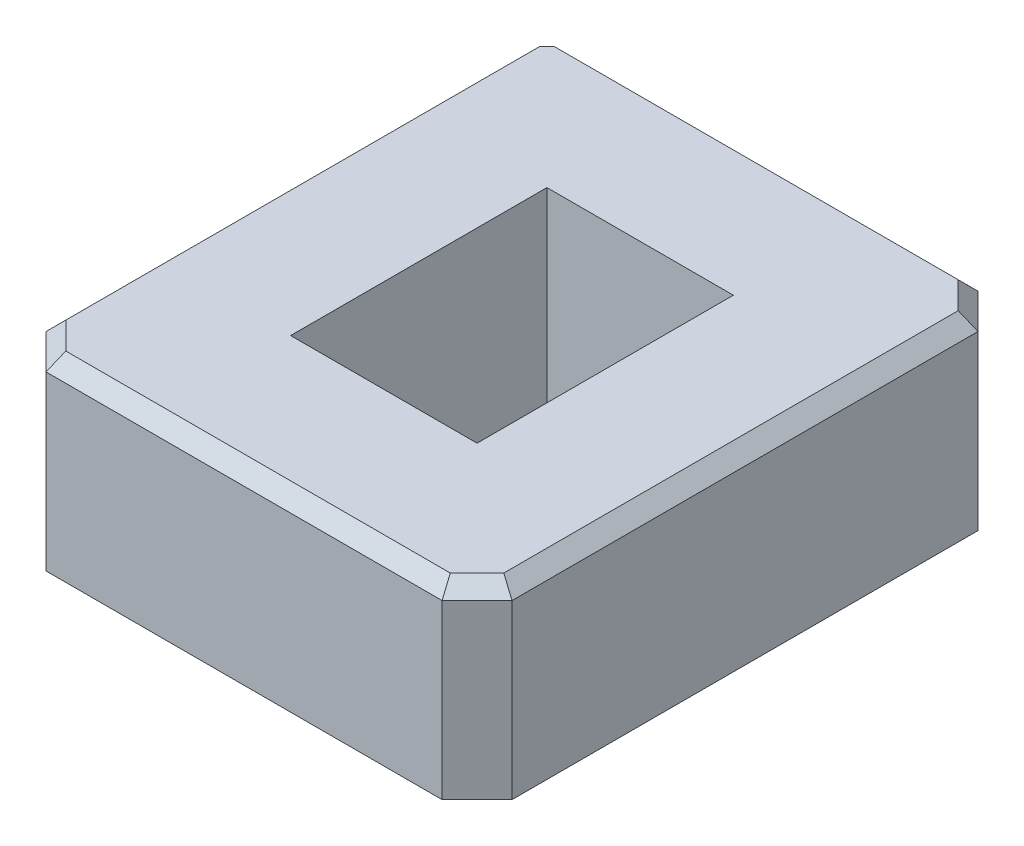
ISO-10303-21;
HEADER;
FILE_DESCRIPTION(('STEP AP214'),'2;1');
FILE_NAME('part.step','',(''),(''),'','','');
FILE_SCHEMA(('AUTOMOTIVE_DESIGN { 1 0 10303 214 1 1 1 1 }'));
ENDSEC;
DATA;
#1=APPLICATION_CONTEXT('core data for automotive mechanical design processes');
#2=APPLICATION_PROTOCOL_DEFINITION('international standard','automotive_design',2000,#1);
#3=PRODUCT_CONTEXT('',#1,'mechanical');
#4=PRODUCT('Part','Part','',(#3));
#5=PRODUCT_RELATED_PRODUCT_CATEGORY('part','',(#4));
#6=PRODUCT_DEFINITION_FORMATION('','',#4);
#7=PRODUCT_DEFINITION_CONTEXT('part definition',#1,'design');
#8=PRODUCT_DEFINITION('design','',#6,#7);
#9=PRODUCT_DEFINITION_SHAPE('','',#8);
#10=(LENGTH_UNIT() NAMED_UNIT(*) SI_UNIT(.MILLI.,.METRE.));
#11=(NAMED_UNIT(*) PLANE_ANGLE_UNIT() SI_UNIT($,.RADIAN.));
#12=(NAMED_UNIT(*) SI_UNIT($,.STERADIAN.) SOLID_ANGLE_UNIT());
#13=UNCERTAINTY_MEASURE_WITH_UNIT(LENGTH_MEASURE(1.E-05),#10,'distance_accuracy_value','');
#14=(GEOMETRIC_REPRESENTATION_CONTEXT(3) GLOBAL_UNCERTAINTY_ASSIGNED_CONTEXT((#13)) GLOBAL_UNIT_ASSIGNED_CONTEXT((#10,
#11,#12)) REPRESENTATION_CONTEXT('',''));
#15=CARTESIAN_POINT('',(0.,0.,0.));
#16=DIRECTION('',(0.,0.,1.));
#17=DIRECTION('',(1.,0.,0.));
#18=AXIS2_PLACEMENT_3D('',#15,#16,#17);
#19=CARTESIAN_POINT('',(0.,8.,0.));
#20=DIRECTION('',(0.,-1.,0.));
#21=DIRECTION('',(0.,0.,-1.));
#22=AXIS2_PLACEMENT_3D('',#19,#20,#21);
#23=PLANE('',#22);
#24=DIRECTION('',(-0.707106781186546,0.,-0.707106781186549));
#25=VECTOR('',#24,1.);
#26=CARTESIAN_POINT('',(8.07573593128806,8.,-11.0757359312881));
#27=LINE('',#26,#25);
#28=CARTESIAN_POINT('',(9.4,8.,-9.75147186257613));
#29=VERTEX_POINT('',#28);
#30=CARTESIAN_POINT('',(8.25147186257613,8.,-10.9));
#31=VERTEX_POINT('',#30);
#32=EDGE_CURVE('E244',#29,#31,#27,.T.);
#33=ORIENTED_EDGE('',*,*,#32,.T.);
#34=DIRECTION('',(-1.,0.,0.));
#35=VECTOR('',#34,1.);
#36=CARTESIAN_POINT('',(0.,8.,-10.9));
#37=LINE('',#36,#35);
#38=CARTESIAN_POINT('',(-9.1,8.,-10.9));
#39=VERTEX_POINT('',#38);
#40=EDGE_CURVE('E246',#31,#39,#37,.T.);
#41=ORIENTED_EDGE('',*,*,#40,.T.);
#42=DIRECTION('',(0.707106781186548,0.,-0.707106781186547));
#43=VECTOR('',#42,1.);
#44=CARTESIAN_POINT('',(-10.,8.,-10.));
#45=LINE('',#44,#43);
#46=CARTESIAN_POINT('',(-9.4,8.,-10.6));
#47=VERTEX_POINT('',#46);
#48=EDGE_CURVE('E222',#39,#47,#45,.F.);
#49=ORIENTED_EDGE('',*,*,#48,.T.);
#50=DIRECTION('',(0.,0.,1.));
#51=VECTOR('',#50,1.);
#52=CARTESIAN_POINT('',(-9.4,8.,0.));
#53=LINE('',#52,#51);
#54=CARTESIAN_POINT('',(-9.4,8.,9.75147186257615));
#55=VERTEX_POINT('',#54);
#56=EDGE_CURVE('E234',#47,#55,#53,.T.);
#57=ORIENTED_EDGE('',*,*,#56,.T.);
#58=DIRECTION('',(0.707106781186547,0.,0.707106781186548));
#59=VECTOR('',#58,1.);
#60=CARTESIAN_POINT('',(-8.07573593128808,8.,11.0757359312881));
#61=LINE('',#60,#59);
#62=CARTESIAN_POINT('',(-8.25147186257615,8.,10.9));
#63=VERTEX_POINT('',#62);
#64=EDGE_CURVE('E236',#55,#63,#61,.T.);
#65=ORIENTED_EDGE('',*,*,#64,.T.);
#66=DIRECTION('',(1.,0.,0.));
#67=VECTOR('',#66,1.);
#68=CARTESIAN_POINT('',(0.,8.,10.9));
#69=LINE('',#68,#67);
#70=CARTESIAN_POINT('',(8.25147186257614,8.,10.9));
#71=VERTEX_POINT('',#70);
#72=EDGE_CURVE('E238',#63,#71,#69,.T.);
#73=ORIENTED_EDGE('',*,*,#72,.T.);
#74=DIRECTION('',(0.707106781186548,0.,-0.707106781186548));
#75=VECTOR('',#74,1.);
#76=CARTESIAN_POINT('',(9.57573593128807,8.,9.57573593128807));
#77=LINE('',#76,#75);
#78=CARTESIAN_POINT('',(9.4,8.,9.75147186257614));
#79=VERTEX_POINT('',#78);
#80=EDGE_CURVE('E240',#71,#79,#77,.T.);
#81=ORIENTED_EDGE('',*,*,#80,.T.);
#82=DIRECTION('',(0.,0.,-1.));
#83=VECTOR('',#82,1.);
#84=CARTESIAN_POINT('',(9.4,8.,0.));
#85=LINE('',#84,#83);
#86=EDGE_CURVE('E242',#79,#29,#85,.T.);
#87=ORIENTED_EDGE('',*,*,#86,.T.);
#88=EDGE_LOOP('',(#33,#41,#49,#57,#65,#73,#81,#87));
#89=FACE_BOUND('',#88,.T.);
#90=DIRECTION('',(0.,0.,-1.));
#91=VECTOR('',#90,1.);
#92=CARTESIAN_POINT('',(4.,8.,5.5));
#93=LINE('',#92,#91);
#94=CARTESIAN_POINT('',(4.,8.,5.5));
#95=VERTEX_POINT('',#94);
#96=CARTESIAN_POINT('',(4.,8.,-5.5));
#97=VERTEX_POINT('',#96);
#98=EDGE_CURVE('E153',#95,#97,#93,.T.);
#99=ORIENTED_EDGE('',*,*,#98,.F.);
#100=DIRECTION('',(1.,0.,0.));
#101=VECTOR('',#100,1.);
#102=CARTESIAN_POINT('',(-4.,8.,5.5));
#103=LINE('',#102,#101);
#104=CARTESIAN_POINT('',(-4.,8.,5.5));
#105=VERTEX_POINT('',#104);
#106=EDGE_CURVE('E178',#105,#95,#103,.T.);
#107=ORIENTED_EDGE('',*,*,#106,.F.);
#108=DIRECTION('',(0.,0.,1.));
#109=VECTOR('',#108,1.);
#110=CARTESIAN_POINT('',(-4.,8.,5.5));
#111=LINE('',#110,#109);
#112=CARTESIAN_POINT('',(-4.,8.,-5.5));
#113=VERTEX_POINT('',#112);
#114=EDGE_CURVE('E176',#113,#105,#111,.T.);
#115=ORIENTED_EDGE('',*,*,#114,.F.);
#116=DIRECTION('',(-1.,0.,0.));
#117=VECTOR('',#116,1.);
#118=CARTESIAN_POINT('',(-4.,8.,-5.5));
#119=LINE('',#118,#117);
#120=EDGE_CURVE('E163',#97,#113,#119,.T.);
#121=ORIENTED_EDGE('',*,*,#120,.F.);
#122=EDGE_LOOP('',(#99,#107,#115,#121));
#123=FACE_BOUND('',#122,.T.);
#124=ADVANCED_FACE('F36',(#89,#123),#23,.F.);
#125=CARTESIAN_POINT('',(0.,0.,0.));
#126=DIRECTION('',(0.,-1.,0.));
#127=DIRECTION('',(0.,0.,-1.));
#128=AXIS2_PLACEMENT_3D('',#125,#126,#127);
#129=PLANE('',#128);
#130=DIRECTION('',(0.,0.,-1.));
#131=VECTOR('',#130,1.);
#132=CARTESIAN_POINT('',(10.,0.,11.5));
#133=LINE('',#132,#131);
#134=CARTESIAN_POINT('',(10.,0.,10.));
#135=VERTEX_POINT('',#134);
#136=CARTESIAN_POINT('',(10.,0.,-9.99999999999998));
#137=VERTEX_POINT('',#136);
#138=EDGE_CURVE('E199',#135,#137,#133,.T.);
#139=ORIENTED_EDGE('',*,*,#138,.F.);
#140=DIRECTION('',(0.707106781186548,0.,-0.707106781186548));
#141=VECTOR('',#140,1.);
#142=CARTESIAN_POINT('',(10.,0.,10.));
#143=LINE('',#142,#141);
#144=CARTESIAN_POINT('',(8.49999999999999,0.,11.5));
#145=VERTEX_POINT('',#144);
#146=EDGE_CURVE('E216',#135,#145,#143,.F.);
#147=ORIENTED_EDGE('',*,*,#146,.T.);
#148=DIRECTION('',(1.,0.,0.));
#149=VECTOR('',#148,1.);
#150=CARTESIAN_POINT('',(-10.,0.,11.5));
#151=LINE('',#150,#149);
#152=CARTESIAN_POINT('',(-8.5,0.,11.5));
#153=VERTEX_POINT('',#152);
#154=EDGE_CURVE('E196',#153,#145,#151,.T.);
#155=ORIENTED_EDGE('',*,*,#154,.F.);
#156=DIRECTION('',(0.707106781186547,0.,0.707106781186548));
#157=VECTOR('',#156,1.);
#158=CARTESIAN_POINT('',(-10.,0.,9.99999999999999));
#159=LINE('',#158,#157);
#160=CARTESIAN_POINT('',(-10.,0.,10.));
#161=VERTEX_POINT('',#160);
#162=EDGE_CURVE('E210',#153,#161,#159,.F.);
#163=ORIENTED_EDGE('',*,*,#162,.T.);
#164=DIRECTION('',(0.,0.,1.));
#165=VECTOR('',#164,1.);
#166=CARTESIAN_POINT('',(-10.,0.,11.5));
#167=LINE('',#166,#165);
#168=CARTESIAN_POINT('',(-10.,0.,-10.));
#169=VERTEX_POINT('',#168);
#170=EDGE_CURVE('E171',#169,#161,#167,.T.);
#171=ORIENTED_EDGE('',*,*,#170,.F.);
#172=DIRECTION('',(-0.707106781186548,0.,0.707106781186547));
#173=VECTOR('',#172,1.);
#174=CARTESIAN_POINT('',(-9.99999999999999,0.,-10.));
#175=LINE('',#174,#173);
#176=CARTESIAN_POINT('',(-8.5,0.,-11.5));
#177=VERTEX_POINT('',#176);
#178=EDGE_CURVE('E212',#169,#177,#175,.F.);
#179=ORIENTED_EDGE('',*,*,#178,.T.);
#180=DIRECTION('',(-1.,0.,0.));
#181=VECTOR('',#180,1.);
#182=CARTESIAN_POINT('',(-10.,0.,-11.5));
#183=LINE('',#182,#181);
#184=CARTESIAN_POINT('',(8.49999999999999,0.,-11.5));
#185=VERTEX_POINT('',#184);
#186=EDGE_CURVE('E202',#185,#177,#183,.T.);
#187=ORIENTED_EDGE('',*,*,#186,.F.);
#188=DIRECTION('',(-0.707106781186546,0.,-0.707106781186549));
#189=VECTOR('',#188,1.);
#190=CARTESIAN_POINT('',(10.,0.,-9.99999999999997));
#191=LINE('',#190,#189);
#192=EDGE_CURVE('E214',#185,#137,#191,.F.);
#193=ORIENTED_EDGE('',*,*,#192,.T.);
#194=EDGE_LOOP('',(#139,#147,#155,#163,#171,#179,#187,#193));
#195=FACE_BOUND('',#194,.T.);
#196=DIRECTION('',(1.,0.,0.));
#197=VECTOR('',#196,1.);
#198=CARTESIAN_POINT('',(-4.,0.,5.5));
#199=LINE('',#198,#197);
#200=CARTESIAN_POINT('',(-4.,0.,5.5));
#201=VERTEX_POINT('',#200);
#202=CARTESIAN_POINT('',(4.,0.,5.5));
#203=VERTEX_POINT('',#202);
#204=EDGE_CURVE('E164',#201,#203,#199,.T.);
#205=ORIENTED_EDGE('',*,*,#204,.T.);
#206=DIRECTION('',(0.,0.,-1.));
#207=VECTOR('',#206,1.);
#208=CARTESIAN_POINT('',(4.,0.,5.5));
#209=LINE('',#208,#207);
#210=CARTESIAN_POINT('',(4.,0.,-5.5));
#211=VERTEX_POINT('',#210);
#212=EDGE_CURVE('E182',#203,#211,#209,.T.);
#213=ORIENTED_EDGE('',*,*,#212,.T.);
#214=DIRECTION('',(-1.,0.,0.));
#215=VECTOR('',#214,1.);
#216=CARTESIAN_POINT('',(-4.,0.,-5.5));
#217=LINE('',#216,#215);
#218=CARTESIAN_POINT('',(-4.,0.,-5.5));
#219=VERTEX_POINT('',#218);
#220=EDGE_CURVE('E170',#211,#219,#217,.T.);
#221=ORIENTED_EDGE('',*,*,#220,.T.);
#222=DIRECTION('',(0.,0.,1.));
#223=VECTOR('',#222,1.);
#224=CARTESIAN_POINT('',(-4.,0.,5.5));
#225=LINE('',#224,#223);
#226=EDGE_CURVE('E185',#219,#201,#225,.T.);
#227=ORIENTED_EDGE('',*,*,#226,.T.);
#228=EDGE_LOOP('',(#205,#213,#221,#227));
#229=FACE_BOUND('',#228,.T.);
#230=ADVANCED_FACE('F300',(#195,#229),#129,.T.);
#231=CARTESIAN_POINT('',(-10.,8.,11.5));
#232=DIRECTION('',(1.,0.,0.));
#233=DIRECTION('',(0.,0.,-1.));
#234=AXIS2_PLACEMENT_3D('',#231,#232,#233);
#235=PLANE('',#234);
#236=DIRECTION('',(0.,1.,0.));
#237=VECTOR('',#236,1.);
#238=CARTESIAN_POINT('',(-10.,8.,10.));
#239=LINE('',#238,#237);
#240=CARTESIAN_POINT('',(-10.,7.4,10.));
#241=VERTEX_POINT('',#240);
#242=EDGE_CURVE('E230',#161,#241,#239,.T.);
#243=ORIENTED_EDGE('',*,*,#242,.T.);
#244=DIRECTION('',(0.,0.,-1.));
#245=VECTOR('',#244,1.);
#246=CARTESIAN_POINT('',(-10.,7.4,11.5));
#247=LINE('',#246,#245);
#248=CARTESIAN_POINT('',(-10.,7.4,-10.));
#249=VERTEX_POINT('',#248);
#250=EDGE_CURVE('E11',#241,#249,#247,.T.);
#251=ORIENTED_EDGE('',*,*,#250,.T.);
#252=DIRECTION('',(0.,-1.,0.));
#253=VECTOR('',#252,1.);
#254=CARTESIAN_POINT('',(-10.,8.,-10.));
#255=LINE('',#254,#253);
#256=EDGE_CURVE('E232',#249,#169,#255,.T.);
#257=ORIENTED_EDGE('',*,*,#256,.T.);
#258=ORIENTED_EDGE('',*,*,#170,.T.);
#259=EDGE_LOOP('',(#243,#251,#257,#258));
#260=FACE_BOUND('',#259,.T.);
#261=ADVANCED_FACE('F290',(#260),#235,.F.);
#262=CARTESIAN_POINT('',(-10.,8.,11.5));
#263=DIRECTION('',(0.,0.,-1.));
#264=DIRECTION('',(-1.,0.,0.));
#265=AXIS2_PLACEMENT_3D('',#262,#263,#264);
#266=PLANE('',#265);
#267=DIRECTION('',(0.,1.,0.));
#268=VECTOR('',#267,1.);
#269=CARTESIAN_POINT('',(8.49999999999999,8.,11.5));
#270=LINE('',#269,#268);
#271=CARTESIAN_POINT('',(8.49999999999999,7.4,11.5));
#272=VERTEX_POINT('',#271);
#273=EDGE_CURVE('E220',#145,#272,#270,.T.);
#274=ORIENTED_EDGE('',*,*,#273,.T.);
#275=DIRECTION('',(-1.,0.,0.));
#276=VECTOR('',#275,1.);
#277=CARTESIAN_POINT('',(-10.,7.4,11.5));
#278=LINE('',#277,#276);
#279=CARTESIAN_POINT('',(-8.5,7.4,11.5));
#280=VERTEX_POINT('',#279);
#281=EDGE_CURVE('E61',#272,#280,#278,.T.);
#282=ORIENTED_EDGE('',*,*,#281,.T.);
#283=DIRECTION('',(0.,-1.,0.));
#284=VECTOR('',#283,1.);
#285=CARTESIAN_POINT('',(-8.5,8.,11.5));
#286=LINE('',#285,#284);
#287=EDGE_CURVE('E218',#280,#153,#286,.T.);
#288=ORIENTED_EDGE('',*,*,#287,.T.);
#289=ORIENTED_EDGE('',*,*,#154,.T.);
#290=EDGE_LOOP('',(#274,#282,#288,#289));
#291=FACE_BOUND('',#290,.T.);
#292=ADVANCED_FACE('F307',(#291),#266,.F.);
#293=CARTESIAN_POINT('',(10.,8.,11.5));
#294=DIRECTION('',(-1.,0.,0.));
#295=DIRECTION('',(0.,0.,1.));
#296=AXIS2_PLACEMENT_3D('',#293,#294,#295);
#297=PLANE('',#296);
#298=DIRECTION('',(0.,1.,0.));
#299=VECTOR('',#298,1.);
#300=CARTESIAN_POINT('',(10.,8.,-9.99999999999998));
#301=LINE('',#300,#299);
#302=CARTESIAN_POINT('',(10.,7.4,-9.99999999999998));
#303=VERTEX_POINT('',#302);
#304=EDGE_CURVE('E205',#137,#303,#301,.T.);
#305=ORIENTED_EDGE('',*,*,#304,.T.);
#306=DIRECTION('',(0.,0.,1.));
#307=VECTOR('',#306,1.);
#308=CARTESIAN_POINT('',(10.,7.4,11.5));
#309=LINE('',#308,#307);
#310=CARTESIAN_POINT('',(10.,7.4,10.));
#311=VERTEX_POINT('',#310);
#312=EDGE_CURVE('E257',#303,#311,#309,.T.);
#313=ORIENTED_EDGE('',*,*,#312,.T.);
#314=DIRECTION('',(0.,-1.,0.));
#315=VECTOR('',#314,1.);
#316=CARTESIAN_POINT('',(10.,8.,10.));
#317=LINE('',#316,#315);
#318=EDGE_CURVE('E208',#311,#135,#317,.T.);
#319=ORIENTED_EDGE('',*,*,#318,.T.);
#320=ORIENTED_EDGE('',*,*,#138,.T.);
#321=EDGE_LOOP('',(#305,#313,#319,#320));
#322=FACE_BOUND('',#321,.T.);
#323=ADVANCED_FACE('F346',(#322),#297,.F.);
#324=CARTESIAN_POINT('',(-10.,8.,-11.5));
#325=DIRECTION('',(0.,0.,1.));
#326=DIRECTION('',(1.,0.,0.));
#327=AXIS2_PLACEMENT_3D('',#324,#325,#326);
#328=PLANE('',#327);
#329=DIRECTION('',(0.,1.,0.));
#330=VECTOR('',#329,1.);
#331=CARTESIAN_POINT('',(-8.5,8.,-11.5));
#332=LINE('',#331,#330);
#333=CARTESIAN_POINT('',(-8.5,7.4,-11.5));
#334=VERTEX_POINT('',#333);
#335=EDGE_CURVE('E225',#177,#334,#332,.T.);
#336=ORIENTED_EDGE('',*,*,#335,.T.);
#337=DIRECTION('',(1.,0.,0.));
#338=VECTOR('',#337,1.);
#339=CARTESIAN_POINT('',(-10.,7.4,-11.5));
#340=LINE('',#339,#338);
#341=CARTESIAN_POINT('',(8.49999999999999,7.4,-11.5));
#342=VERTEX_POINT('',#341);
#343=EDGE_CURVE('E253',#334,#342,#340,.T.);
#344=ORIENTED_EDGE('',*,*,#343,.T.);
#345=DIRECTION('',(0.,-1.,0.));
#346=VECTOR('',#345,1.);
#347=CARTESIAN_POINT('',(8.49999999999999,8.,-11.5));
#348=LINE('',#347,#346);
#349=EDGE_CURVE('E228',#342,#185,#348,.T.);
#350=ORIENTED_EDGE('',*,*,#349,.T.);
#351=ORIENTED_EDGE('',*,*,#186,.T.);
#352=EDGE_LOOP('',(#336,#344,#350,#351));
#353=FACE_BOUND('',#352,.T.);
#354=ADVANCED_FACE('F343',(#353),#328,.F.);
#355=CARTESIAN_POINT('',(4.,8.,5.5));
#356=DIRECTION('',(-1.,0.,0.));
#357=DIRECTION('',(0.,0.,1.));
#358=AXIS2_PLACEMENT_3D('',#355,#356,#357);
#359=PLANE('',#358);
#360=ORIENTED_EDGE('',*,*,#212,.F.);
#361=DIRECTION('',(0.,-1.,0.));
#362=VECTOR('',#361,1.);
#363=CARTESIAN_POINT('',(4.,8.,5.5));
#364=LINE('',#363,#362);
#365=EDGE_CURVE('E159',#95,#203,#364,.T.);
#366=ORIENTED_EDGE('',*,*,#365,.F.);
#367=ORIENTED_EDGE('',*,*,#98,.T.);
#368=DIRECTION('',(0.,-1.,0.));
#369=VECTOR('',#368,1.);
#370=CARTESIAN_POINT('',(4.,8.,-5.5));
#371=LINE('',#370,#369);
#372=EDGE_CURVE('E156',#97,#211,#371,.T.);
#373=ORIENTED_EDGE('',*,*,#372,.T.);
#374=EDGE_LOOP('',(#360,#366,#367,#373));
#375=FACE_BOUND('',#374,.T.);
#376=ADVANCED_FACE('F155',(#375),#359,.T.);
#377=CARTESIAN_POINT('',(-4.,8.,-5.5));
#378=DIRECTION('',(0.,0.,1.));
#379=DIRECTION('',(1.,0.,0.));
#380=AXIS2_PLACEMENT_3D('',#377,#378,#379);
#381=PLANE('',#380);
#382=ORIENTED_EDGE('',*,*,#220,.F.);
#383=ORIENTED_EDGE('',*,*,#372,.F.);
#384=ORIENTED_EDGE('',*,*,#120,.T.);
#385=DIRECTION('',(0.,-1.,0.));
#386=VECTOR('',#385,1.);
#387=CARTESIAN_POINT('',(-4.,8.,-5.5));
#388=LINE('',#387,#386);
#389=EDGE_CURVE('E172',#113,#219,#388,.T.);
#390=ORIENTED_EDGE('',*,*,#389,.T.);
#391=EDGE_LOOP('',(#382,#383,#384,#390));
#392=FACE_BOUND('',#391,.T.);
#393=ADVANCED_FACE('F167',(#392),#381,.T.);
#394=CARTESIAN_POINT('',(-4.,8.,5.5));
#395=DIRECTION('',(1.,0.,0.));
#396=DIRECTION('',(0.,0.,-1.));
#397=AXIS2_PLACEMENT_3D('',#394,#395,#396);
#398=PLANE('',#397);
#399=ORIENTED_EDGE('',*,*,#226,.F.);
#400=ORIENTED_EDGE('',*,*,#389,.F.);
#401=ORIENTED_EDGE('',*,*,#114,.T.);
#402=DIRECTION('',(0.,-1.,0.));
#403=VECTOR('',#402,1.);
#404=CARTESIAN_POINT('',(-4.,8.,5.5));
#405=LINE('',#404,#403);
#406=EDGE_CURVE('E191',#105,#201,#405,.T.);
#407=ORIENTED_EDGE('',*,*,#406,.T.);
#408=EDGE_LOOP('',(#399,#400,#401,#407));
#409=FACE_BOUND('',#408,.T.);
#410=ADVANCED_FACE('F472',(#409),#398,.T.);
#411=CARTESIAN_POINT('',(-4.,8.,5.5));
#412=DIRECTION('',(0.,0.,-1.));
#413=DIRECTION('',(-1.,0.,0.));
#414=AXIS2_PLACEMENT_3D('',#411,#412,#413);
#415=PLANE('',#414);
#416=ORIENTED_EDGE('',*,*,#204,.F.);
#417=ORIENTED_EDGE('',*,*,#406,.F.);
#418=ORIENTED_EDGE('',*,*,#106,.T.);
#419=ORIENTED_EDGE('',*,*,#365,.T.);
#420=EDGE_LOOP('',(#416,#417,#418,#419));
#421=FACE_BOUND('',#420,.T.);
#422=ADVANCED_FACE('F362',(#421),#415,.T.);
#423=CARTESIAN_POINT('',(10.,8.,10.));
#424=DIRECTION('',(-0.707106781186547,0.,-0.707106781186547));
#425=DIRECTION('',(0.,-1.,0.));
#426=AXIS2_PLACEMENT_3D('',#423,#424,#425);
#427=PLANE('',#426);
#428=ORIENTED_EDGE('',*,*,#318,.F.);
#429=DIRECTION('',(0.707106781186548,0.,-0.707106781186548));
#430=VECTOR('',#429,1.);
#431=CARTESIAN_POINT('',(8.49999999999999,7.4,11.5));
#432=LINE('',#431,#430);
#433=EDGE_CURVE('E259',#311,#272,#432,.F.);
#434=ORIENTED_EDGE('',*,*,#433,.T.);
#435=ORIENTED_EDGE('',*,*,#273,.F.);
#436=ORIENTED_EDGE('',*,*,#146,.F.);
#437=EDGE_LOOP('',(#428,#434,#435,#436));
#438=FACE_BOUND('',#437,.T.);
#439=ADVANCED_FACE('F310',(#438),#427,.F.);
#440=CARTESIAN_POINT('',(8.49999999999999,8.,-11.5));
#441=DIRECTION('',(-0.707106781186549,0.,0.707106781186546));
#442=DIRECTION('',(0.,-1.,0.));
#443=AXIS2_PLACEMENT_3D('',#440,#441,#442);
#444=PLANE('',#443);
#445=ORIENTED_EDGE('',*,*,#349,.F.);
#446=DIRECTION('',(-0.707106781186546,0.,-0.707106781186549));
#447=VECTOR('',#446,1.);
#448=CARTESIAN_POINT('',(10.,7.4,-9.99999999999998));
#449=LINE('',#448,#447);
#450=EDGE_CURVE('E255',#342,#303,#449,.F.);
#451=ORIENTED_EDGE('',*,*,#450,.T.);
#452=ORIENTED_EDGE('',*,*,#304,.F.);
#453=ORIENTED_EDGE('',*,*,#192,.F.);
#454=EDGE_LOOP('',(#445,#451,#452,#453));
#455=FACE_BOUND('',#454,.T.);
#456=ADVANCED_FACE('F361',(#455),#444,.F.);
#457=CARTESIAN_POINT('',(-10.,8.,-10.));
#458=DIRECTION('',(0.707106781186547,0.,0.707106781186548));
#459=DIRECTION('',(0.,-1.,0.));
#460=AXIS2_PLACEMENT_3D('',#457,#458,#459);
#461=PLANE('',#460);
#462=ORIENTED_EDGE('',*,*,#48,.F.);
#463=DIRECTION('',(0.577350269189625,-0.577350269189628,-0.577350269189624));
#464=VECTOR('',#463,1.);
#465=CARTESIAN_POINT('',(-9.7,8.6,-10.3));
#466=LINE('',#465,#464);
#467=EDGE_CURVE('E251',#39,#334,#466,.T.);
#468=ORIENTED_EDGE('',*,*,#467,.T.);
#469=ORIENTED_EDGE('',*,*,#335,.F.);
#470=ORIENTED_EDGE('',*,*,#178,.F.);
#471=ORIENTED_EDGE('',*,*,#256,.F.);
#472=DIRECTION('',(0.577350269189625,0.577350269189629,-0.577350269189624));
#473=VECTOR('',#472,1.);
#474=CARTESIAN_POINT('',(-9.8,7.6,-10.2));
#475=LINE('',#474,#473);
#476=EDGE_CURVE('E249',#249,#47,#475,.T.);
#477=ORIENTED_EDGE('',*,*,#476,.T.);
#478=EDGE_LOOP('',(#462,#468,#469,#470,#471,#477));
#479=FACE_BOUND('',#478,.T.);
#480=ADVANCED_FACE('F294',(#479),#461,.F.);
#481=CARTESIAN_POINT('',(-8.5,8.,11.5));
#482=DIRECTION('',(0.707106781186548,0.,-0.707106781186547));
#483=DIRECTION('',(0.,-1.,0.));
#484=AXIS2_PLACEMENT_3D('',#481,#482,#483);
#485=PLANE('',#484);
#486=ORIENTED_EDGE('',*,*,#287,.F.);
#487=DIRECTION('',(0.707106781186547,0.,0.707106781186548));
#488=VECTOR('',#487,1.);
#489=CARTESIAN_POINT('',(-10.,7.4,10.));
#490=LINE('',#489,#488);
#491=EDGE_CURVE('E46',#280,#241,#490,.F.);
#492=ORIENTED_EDGE('',*,*,#491,.T.);
#493=ORIENTED_EDGE('',*,*,#242,.F.);
#494=ORIENTED_EDGE('',*,*,#162,.F.);
#495=EDGE_LOOP('',(#486,#492,#493,#494));
#496=FACE_BOUND('',#495,.T.);
#497=ADVANCED_FACE('F304',(#496),#485,.F.);
#498=CARTESIAN_POINT('',(-9.4,8.,0.));
#499=DIRECTION('',(0.70710678118655,-0.707106781186546,0.));
#500=DIRECTION('',(0.,0.,1.));
#501=AXIS2_PLACEMENT_3D('',#498,#499,#500);
#502=PLANE('',#501);
#503=ORIENTED_EDGE('',*,*,#476,.F.);
#504=ORIENTED_EDGE('',*,*,#250,.F.);
#505=DIRECTION('',(0.678598344545846,0.67859834454585,-0.281084637714817));
#506=VECTOR('',#505,1.);
#507=CARTESIAN_POINT('',(-7.53996944583013,9.86003055416989,8.98102198061065));
#508=LINE('',#507,#506);
#509=EDGE_CURVE('E41',#55,#241,#508,.F.);
#510=ORIENTED_EDGE('',*,*,#509,.F.);
#511=ORIENTED_EDGE('',*,*,#56,.F.);
#512=EDGE_LOOP('',(#503,#504,#510,#511));
#513=FACE_BOUND('',#512,.T.);
#514=ADVANCED_FACE('F39',(#513),#502,.F.);
#515=CARTESIAN_POINT('',(-9.57573593128808,8.,9.57573593128806));
#516=DIRECTION('',(0.500000000000003,-0.707106781186545,-0.500000000000001));
#517=DIRECTION('',(0.707106781186547,0.,0.707106781186548));
#518=AXIS2_PLACEMENT_3D('',#515,#516,#517);
#519=PLANE('',#518);
#520=ORIENTED_EDGE('',*,*,#509,.T.);
#521=ORIENTED_EDGE('',*,*,#491,.F.);
#522=DIRECTION('',(0.281084637714818,0.67859834454585,-0.678598344545846));
#523=VECTOR('',#522,1.);
#524=CARTESIAN_POINT('',(-8.10350522179644,8.35722307094917,10.5427769290508));
#525=LINE('',#524,#523);
#526=EDGE_CURVE('E274',#63,#280,#525,.F.);
#527=ORIENTED_EDGE('',*,*,#526,.F.);
#528=ORIENTED_EDGE('',*,*,#64,.F.);
#529=EDGE_LOOP('',(#520,#521,#527,#528));
#530=FACE_BOUND('',#529,.T.);
#531=ADVANCED_FACE('F283',(#530),#519,.F.);
#532=CARTESIAN_POINT('',(0.,8.,10.9));
#533=DIRECTION('',(0.,-0.707106781186546,-0.70710678118655));
#534=DIRECTION('',(1.,0.,0.));
#535=AXIS2_PLACEMENT_3D('',#532,#533,#534);
#536=PLANE('',#535);
#537=ORIENTED_EDGE('',*,*,#526,.T.);
#538=ORIENTED_EDGE('',*,*,#281,.F.);
#539=DIRECTION('',(-0.281084637714819,0.678598344545849,-0.678598344545845));
#540=VECTOR('',#539,1.);
#541=CARTESIAN_POINT('',(7.59953484094953,9.57391519942408,9.32608480057593));
#542=LINE('',#541,#540);
#543=EDGE_CURVE('E272',#71,#272,#542,.F.);
#544=ORIENTED_EDGE('',*,*,#543,.F.);
#545=ORIENTED_EDGE('',*,*,#72,.F.);
#546=EDGE_LOOP('',(#537,#538,#544,#545));
#547=FACE_BOUND('',#546,.T.);
#548=ADVANCED_FACE('F325',(#547),#536,.F.);
#549=CARTESIAN_POINT('',(9.57573593128807,8.,9.57573593128807));
#550=DIRECTION('',(-0.500000000000002,-0.707106781186545,-0.500000000000002));
#551=DIRECTION('',(0.707106781186548,0.,-0.707106781186548));
#552=AXIS2_PLACEMENT_3D('',#549,#550,#551);
#553=PLANE('',#552);
#554=ORIENTED_EDGE('',*,*,#543,.T.);
#555=ORIENTED_EDGE('',*,*,#433,.F.);
#556=DIRECTION('',(-0.678598344545845,0.678598344545849,-0.281084637714819));
#557=VECTOR('',#556,1.);
#558=CARTESIAN_POINT('',(9.44740514413556,7.95259485586444,9.77110771620334));
#559=LINE('',#558,#557);
#560=EDGE_CURVE('E269',#79,#311,#559,.F.);
#561=ORIENTED_EDGE('',*,*,#560,.F.);
#562=ORIENTED_EDGE('',*,*,#80,.F.);
#563=EDGE_LOOP('',(#554,#555,#561,#562));
#564=FACE_BOUND('',#563,.T.);
#565=ADVANCED_FACE('F314',(#564),#553,.F.);
#566=CARTESIAN_POINT('',(9.4,8.,0.));
#567=DIRECTION('',(-0.70710678118655,-0.707106781186546,0.));
#568=DIRECTION('',(0.,0.,-1.));
#569=AXIS2_PLACEMENT_3D('',#566,#567,#568);
#570=PLANE('',#569);
#571=ORIENTED_EDGE('',*,*,#560,.T.);
#572=ORIENTED_EDGE('',*,*,#312,.F.);
#573=DIRECTION('',(-0.678598344545845,0.678598344545849,0.28108463771482));
#574=VECTOR('',#573,1.);
#575=CARTESIAN_POINT('',(7.53996944583011,9.8600305541699,-8.98102198061061));
#576=LINE('',#575,#574);
#577=EDGE_CURVE('E266',#29,#303,#576,.F.);
#578=ORIENTED_EDGE('',*,*,#577,.F.);
#579=ORIENTED_EDGE('',*,*,#86,.F.);
#580=EDGE_LOOP('',(#571,#572,#578,#579));
#581=FACE_BOUND('',#580,.T.);
#582=ADVANCED_FACE('F320',(#581),#570,.F.);
#583=CARTESIAN_POINT('',(9.57573593128808,8.,-9.57573593128805));
#584=DIRECTION('',(-0.500000000000002,-0.707106781186546,0.5));
#585=DIRECTION('',(-0.707106781186546,0.,-0.707106781186549));
#586=AXIS2_PLACEMENT_3D('',#583,#584,#585);
#587=PLANE('',#586);
#588=ORIENTED_EDGE('',*,*,#577,.T.);
#589=ORIENTED_EDGE('',*,*,#450,.F.);
#590=DIRECTION('',(-0.281084637714822,0.678598344545849,0.678598344545844));
#591=VECTOR('',#590,1.);
#592=CARTESIAN_POINT('',(8.10350522179642,8.35722307094917,-10.5427769290508));
#593=LINE('',#592,#591);
#594=EDGE_CURVE('E263',#31,#342,#593,.F.);
#595=ORIENTED_EDGE('',*,*,#594,.F.);
#596=ORIENTED_EDGE('',*,*,#32,.F.);
#597=EDGE_LOOP('',(#588,#589,#595,#596));
#598=FACE_BOUND('',#597,.T.);
#599=ADVANCED_FACE('F385',(#598),#587,.F.);
#600=CARTESIAN_POINT('',(0.,8.,-10.9));
#601=DIRECTION('',(0.,-0.707106781186545,0.70710678118655));
#602=DIRECTION('',(-1.,0.,0.));
#603=AXIS2_PLACEMENT_3D('',#600,#601,#602);
#604=PLANE('',#603);
#605=ORIENTED_EDGE('',*,*,#594,.T.);
#606=ORIENTED_EDGE('',*,*,#343,.F.);
#607=ORIENTED_EDGE('',*,*,#467,.F.);
#608=ORIENTED_EDGE('',*,*,#40,.F.);
#609=EDGE_LOOP('',(#605,#606,#607,#608));
#610=FACE_BOUND('',#609,.T.);
#611=ADVANCED_FACE('F379',(#610),#604,.F.);
#612=CLOSED_SHELL('',(#124,#230,#261,#292,#323,#354,#376,#393,#410,#422,#439,#456,#480,#497,
#514,#531,#548,#565,#582,#599,#611));
#613=MANIFOLD_SOLID_BREP('B2',#612);
#614=ADVANCED_BREP_SHAPE_REPRESENTATION('',(#18,#613),#14);
#615=SHAPE_DEFINITION_REPRESENTATION(#9,#614);
ENDSEC;
END-ISO-10303-21;
